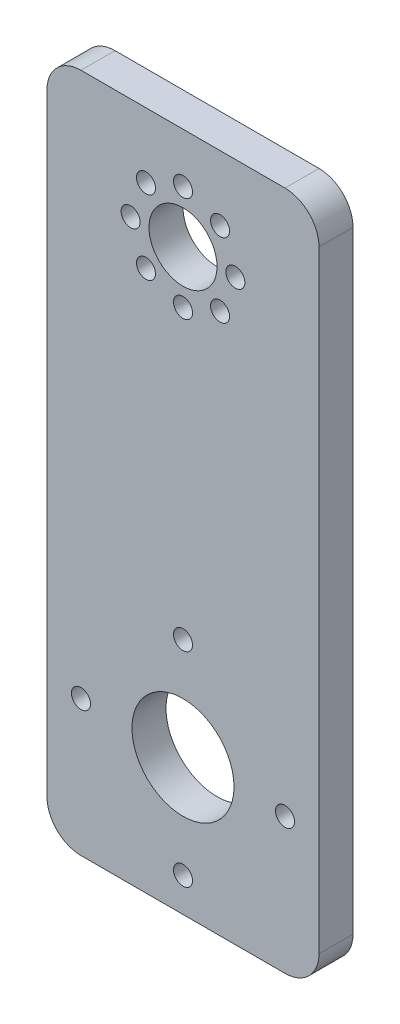
ISO-10303-21;
HEADER;
FILE_DESCRIPTION(('STEP AP214'),'2;1');
FILE_NAME('part.step','',(''),(''),'','','');
FILE_SCHEMA(('AUTOMOTIVE_DESIGN { 1 0 10303 214 1 1 1 1 }'));
ENDSEC;
DATA;
#1=APPLICATION_CONTEXT('core data for automotive mechanical design processes');
#2=APPLICATION_PROTOCOL_DEFINITION('international standard','automotive_design',2000,#1);
#3=PRODUCT_CONTEXT('',#1,'mechanical');
#4=PRODUCT('Part','Part','',(#3));
#5=PRODUCT_RELATED_PRODUCT_CATEGORY('part','',(#4));
#6=PRODUCT_DEFINITION_FORMATION('','',#4);
#7=PRODUCT_DEFINITION_CONTEXT('part definition',#1,'design');
#8=PRODUCT_DEFINITION('design','',#6,#7);
#9=PRODUCT_DEFINITION_SHAPE('','',#8);
#10=(LENGTH_UNIT() NAMED_UNIT(*) SI_UNIT(.MILLI.,.METRE.));
#11=(NAMED_UNIT(*) PLANE_ANGLE_UNIT() SI_UNIT($,.RADIAN.));
#12=(NAMED_UNIT(*) SI_UNIT($,.STERADIAN.) SOLID_ANGLE_UNIT());
#13=UNCERTAINTY_MEASURE_WITH_UNIT(LENGTH_MEASURE(1.E-05),#10,'distance_accuracy_value','');
#14=(GEOMETRIC_REPRESENTATION_CONTEXT(3) GLOBAL_UNCERTAINTY_ASSIGNED_CONTEXT((#13)) GLOBAL_UNIT_ASSIGNED_CONTEXT((#10,
#11,#12)) REPRESENTATION_CONTEXT('',''));
#15=CARTESIAN_POINT('',(0.,0.,0.));
#16=DIRECTION('',(0.,0.,1.));
#17=DIRECTION('',(1.,0.,0.));
#18=AXIS2_PLACEMENT_3D('',#15,#16,#17);
#19=CARTESIAN_POINT('',(0.,0.,6.35));
#20=DIRECTION('',(0.,0.,-1.));
#21=DIRECTION('',(-1.,0.,0.));
#22=AXIS2_PLACEMENT_3D('',#19,#20,#21);
#23=PLANE('',#22);
#24=CARTESIAN_POINT('',(15.621,107.95,6.35));
#25=DIRECTION('',(0.,0.,1.));
#26=DIRECTION('',(0.,1.,0.));
#27=AXIS2_PLACEMENT_3D('',#24,#25,#26);
#28=CIRCLE('',#27,1.778);
#29=CARTESIAN_POINT('',(15.621,109.728,6.35));
#30=VERTEX_POINT('',#29);
#31=EDGE_CURVE('E490',#30,#30,#28,.T.);
#32=ORIENTED_EDGE('',*,*,#31,.F.);
#33=EDGE_LOOP('',(#32));
#34=FACE_BOUND('',#33,.T.);
#35=CARTESIAN_POINT('',(18.4852027867768,101.035202786777,6.35));
#36=DIRECTION('',(0.,0.,1.));
#37=DIRECTION('',(-0.707106781186551,0.707106781186544,0.));
#38=AXIS2_PLACEMENT_3D('',#35,#36,#37);
#39=CIRCLE('',#38,1.778);
#40=CARTESIAN_POINT('',(17.2279669298271,102.292438643726,6.35));
#41=VERTEX_POINT('',#40);
#42=EDGE_CURVE('E484',#41,#41,#39,.T.);
#43=ORIENTED_EDGE('',*,*,#42,.F.);
#44=EDGE_LOOP('',(#43));
#45=FACE_BOUND('',#44,.T.);
#46=CARTESIAN_POINT('',(25.4,98.171,6.35));
#47=DIRECTION('',(0.,0.,1.));
#48=DIRECTION('',(-1.,0.,0.));
#49=AXIS2_PLACEMENT_3D('',#46,#47,#48);
#50=CIRCLE('',#49,1.778);
#51=CARTESIAN_POINT('',(23.622,98.171,6.35));
#52=VERTEX_POINT('',#51);
#53=EDGE_CURVE('E478',#52,#52,#50,.T.);
#54=ORIENTED_EDGE('',*,*,#53,.F.);
#55=EDGE_LOOP('',(#54));
#56=FACE_BOUND('',#55,.T.);
#57=CARTESIAN_POINT('',(32.3147972132233,101.035202786777,6.35));
#58=DIRECTION('',(0.,0.,1.));
#59=DIRECTION('',(-0.707106781186541,-0.707106781186554,0.));
#60=AXIS2_PLACEMENT_3D('',#57,#58,#59);
#61=CIRCLE('',#60,1.778);
#62=CARTESIAN_POINT('',(31.0575613562736,99.7779669298271,6.35));
#63=VERTEX_POINT('',#62);
#64=EDGE_CURVE('E471',#63,#63,#61,.T.);
#65=ORIENTED_EDGE('',*,*,#64,.F.);
#66=EDGE_LOOP('',(#65));
#67=FACE_BOUND('',#66,.T.);
#68=CARTESIAN_POINT('',(35.179,107.95,6.35));
#69=DIRECTION('',(0.,0.,1.));
#70=DIRECTION('',(0.,-1.,0.));
#71=AXIS2_PLACEMENT_3D('',#68,#69,#70);
#72=CIRCLE('',#71,1.778);
#73=CARTESIAN_POINT('',(35.179,106.172,6.35));
#74=VERTEX_POINT('',#73);
#75=EDGE_CURVE('E500',#74,#74,#72,.T.);
#76=ORIENTED_EDGE('',*,*,#75,.F.);
#77=EDGE_LOOP('',(#76));
#78=FACE_BOUND('',#77,.T.);
#79=CARTESIAN_POINT('',(32.3147972132232,114.864797213223,6.35));
#80=DIRECTION('',(0.,0.,1.));
#81=DIRECTION('',(0.707106781186556,-0.707106781186539,0.));
#82=AXIS2_PLACEMENT_3D('',#79,#80,#81);
#83=CIRCLE('',#82,1.778);
#84=CARTESIAN_POINT('',(33.5720330701729,113.607561356274,6.35));
#85=VERTEX_POINT('',#84);
#86=EDGE_CURVE('E494',#85,#85,#83,.T.);
#87=ORIENTED_EDGE('',*,*,#86,.F.);
#88=EDGE_LOOP('',(#87));
#89=FACE_BOUND('',#88,.T.);
#90=CARTESIAN_POINT('',(18.4852027867767,114.864797213223,6.35));
#91=DIRECTION('',(0.,0.,1.));
#92=DIRECTION('',(0.707106781186546,0.707106781186549,0.));
#93=AXIS2_PLACEMENT_3D('',#90,#91,#92);
#94=CIRCLE('',#93,1.778);
#95=CARTESIAN_POINT('',(19.7424386437264,116.122033070173,6.35));
#96=VERTEX_POINT('',#95);
#97=EDGE_CURVE('E465',#96,#96,#94,.T.);
#98=ORIENTED_EDGE('',*,*,#97,.F.);
#99=EDGE_LOOP('',(#98));
#100=FACE_BOUND('',#99,.T.);
#101=CARTESIAN_POINT('',(25.4,117.729,6.35));
#102=DIRECTION('',(0.,0.,1.));
#103=DIRECTION('',(1.,0.,0.));
#104=AXIS2_PLACEMENT_3D('',#101,#102,#103);
#105=CIRCLE('',#104,1.778);
#106=CARTESIAN_POINT('',(27.178,117.729,6.35));
#107=VERTEX_POINT('',#106);
#108=EDGE_CURVE('E443',#107,#107,#105,.T.);
#109=ORIENTED_EDGE('',*,*,#108,.F.);
#110=EDGE_LOOP('',(#109));
#111=FACE_BOUND('',#110,.T.);
#112=CARTESIAN_POINT('',(6.35,25.3999999999999,6.35));
#113=DIRECTION('',(0.,0.,1.));
#114=DIRECTION('',(0.,1.,0.));
#115=AXIS2_PLACEMENT_3D('',#112,#113,#114);
#116=CIRCLE('',#115,1.778);
#117=CARTESIAN_POINT('',(6.35,27.1779999999999,6.35));
#118=VERTEX_POINT('',#117);
#119=EDGE_CURVE('E435',#118,#118,#116,.T.);
#120=ORIENTED_EDGE('',*,*,#119,.F.);
#121=EDGE_LOOP('',(#120));
#122=FACE_BOUND('',#121,.T.);
#123=CARTESIAN_POINT('',(25.4,6.35000000000001,6.35));
#124=DIRECTION('',(0.,0.,1.));
#125=DIRECTION('',(-1.,0.,0.));
#126=AXIS2_PLACEMENT_3D('',#123,#124,#125);
#127=CIRCLE('',#126,1.778);
#128=CARTESIAN_POINT('',(23.622,6.35000000000001,6.35));
#129=VERTEX_POINT('',#128);
#130=EDGE_CURVE('E448',#129,#129,#127,.T.);
#131=ORIENTED_EDGE('',*,*,#130,.F.);
#132=EDGE_LOOP('',(#131));
#133=FACE_BOUND('',#132,.T.);
#134=CARTESIAN_POINT('',(44.45,25.4000000000002,6.35));
#135=DIRECTION('',(0.,0.,1.));
#136=DIRECTION('',(0.,-1.,0.));
#137=AXIS2_PLACEMENT_3D('',#134,#135,#136);
#138=CIRCLE('',#137,1.778);
#139=CARTESIAN_POINT('',(44.45,23.6220000000002,6.35));
#140=VERTEX_POINT('',#139);
#141=EDGE_CURVE('E454',#140,#140,#138,.T.);
#142=ORIENTED_EDGE('',*,*,#141,.F.);
#143=EDGE_LOOP('',(#142));
#144=FACE_BOUND('',#143,.T.);
#145=CARTESIAN_POINT('',(25.4,44.45,6.35));
#146=DIRECTION('',(0.,0.,1.));
#147=DIRECTION('',(1.,0.,0.));
#148=AXIS2_PLACEMENT_3D('',#145,#146,#147);
#149=CIRCLE('',#148,1.778);
#150=CARTESIAN_POINT('',(27.178,44.45,6.35));
#151=VERTEX_POINT('',#150);
#152=EDGE_CURVE('E194',#151,#151,#149,.T.);
#153=ORIENTED_EDGE('',*,*,#152,.F.);
#154=EDGE_LOOP('',(#153));
#155=FACE_BOUND('',#154,.T.);
#156=DIRECTION('',(0.,-1.,0.));
#157=VECTOR('',#156,1.);
#158=CARTESIAN_POINT('',(0.,0.,6.35));
#159=LINE('',#158,#157);
#160=CARTESIAN_POINT('',(0.,120.65,6.35));
#161=VERTEX_POINT('',#160);
#162=CARTESIAN_POINT('',(0.,6.35,6.35));
#163=VERTEX_POINT('',#162);
#164=EDGE_CURVE('E135',#161,#163,#159,.T.);
#165=ORIENTED_EDGE('',*,*,#164,.T.);
#166=CARTESIAN_POINT('',(6.35,6.35,6.35));
#167=DIRECTION('',(0.,0.,-1.));
#168=DIRECTION('',(-1.,0.,0.));
#169=AXIS2_PLACEMENT_3D('',#166,#167,#168);
#170=CIRCLE('',#169,6.35);
#171=CARTESIAN_POINT('',(6.35,0.,6.35));
#172=VERTEX_POINT('',#171);
#173=EDGE_CURVE('E150',#163,#172,#170,.F.);
#174=ORIENTED_EDGE('',*,*,#173,.T.);
#175=DIRECTION('',(1.,0.,0.));
#176=VECTOR('',#175,1.);
#177=CARTESIAN_POINT('',(0.,0.,6.35));
#178=LINE('',#177,#176);
#179=CARTESIAN_POINT('',(44.45,0.,6.35));
#180=VERTEX_POINT('',#179);
#181=EDGE_CURVE('E117',#172,#180,#178,.T.);
#182=ORIENTED_EDGE('',*,*,#181,.T.);
#183=CARTESIAN_POINT('',(44.45,6.35,6.35));
#184=DIRECTION('',(0.,0.,-1.));
#185=DIRECTION('',(-1.,0.,0.));
#186=AXIS2_PLACEMENT_3D('',#183,#184,#185);
#187=CIRCLE('',#186,6.35);
#188=CARTESIAN_POINT('',(50.8,6.35,6.35));
#189=VERTEX_POINT('',#188);
#190=EDGE_CURVE('E148',#180,#189,#187,.F.);
#191=ORIENTED_EDGE('',*,*,#190,.T.);
#192=DIRECTION('',(0.,1.,0.));
#193=VECTOR('',#192,1.);
#194=CARTESIAN_POINT('',(50.8,0.,6.35));
#195=LINE('',#194,#193);
#196=CARTESIAN_POINT('',(50.8,120.65,6.35));
#197=VERTEX_POINT('',#196);
#198=EDGE_CURVE('E170',#189,#197,#195,.T.);
#199=ORIENTED_EDGE('',*,*,#198,.T.);
#200=CARTESIAN_POINT('',(44.45,120.65,6.35));
#201=DIRECTION('',(0.,0.,-1.));
#202=DIRECTION('',(-1.,0.,0.));
#203=AXIS2_PLACEMENT_3D('',#200,#201,#202);
#204=CIRCLE('',#203,6.35);
#205=CARTESIAN_POINT('',(44.45,127.,6.35));
#206=VERTEX_POINT('',#205);
#207=EDGE_CURVE('E52',#197,#206,#204,.F.);
#208=ORIENTED_EDGE('',*,*,#207,.T.);
#209=DIRECTION('',(-1.,0.,0.));
#210=VECTOR('',#209,1.);
#211=CARTESIAN_POINT('',(0.,127.,6.35));
#212=LINE('',#211,#210);
#213=CARTESIAN_POINT('',(6.35,127.,6.35));
#214=VERTEX_POINT('',#213);
#215=EDGE_CURVE('E136',#206,#214,#212,.T.);
#216=ORIENTED_EDGE('',*,*,#215,.T.);
#217=CARTESIAN_POINT('',(6.35,120.65,6.35));
#218=DIRECTION('',(0.,0.,-1.));
#219=DIRECTION('',(-1.,0.,0.));
#220=AXIS2_PLACEMENT_3D('',#217,#218,#219);
#221=CIRCLE('',#220,6.35);
#222=EDGE_CURVE('E146',#214,#161,#221,.F.);
#223=ORIENTED_EDGE('',*,*,#222,.T.);
#224=EDGE_LOOP('',(#165,#174,#182,#191,#199,#208,#216,#223));
#225=FACE_BOUND('',#224,.T.);
#226=CARTESIAN_POINT('',(25.4,25.4,6.35));
#227=DIRECTION('',(0.,0.,1.));
#228=DIRECTION('',(1.,0.,0.));
#229=AXIS2_PLACEMENT_3D('',#226,#227,#228);
#230=CIRCLE('',#229,9.525);
#231=CARTESIAN_POINT('',(34.925,25.4,6.35));
#232=VERTEX_POINT('',#231);
#233=EDGE_CURVE('E130',#232,#232,#230,.T.);
#234=ORIENTED_EDGE('',*,*,#233,.F.);
#235=EDGE_LOOP('',(#234));
#236=FACE_BOUND('',#235,.T.);
#237=CARTESIAN_POINT('',(25.4,107.95,6.35));
#238=DIRECTION('',(0.,0.,1.));
#239=DIRECTION('',(1.,0.,0.));
#240=AXIS2_PLACEMENT_3D('',#237,#238,#239);
#241=CIRCLE('',#240,6.35);
#242=CARTESIAN_POINT('',(31.75,107.95,6.35));
#243=VERTEX_POINT('',#242);
#244=EDGE_CURVE('E185',#243,#243,#241,.T.);
#245=ORIENTED_EDGE('',*,*,#244,.F.);
#246=EDGE_LOOP('',(#245));
#247=FACE_BOUND('',#246,.T.);
#248=ADVANCED_FACE('F32',(#34,#45,#56,#67,#78,#89,#100,#111,#122,#133,#144,#155,#225,#236,#247),
#23,.F.);
#249=CARTESIAN_POINT('',(0.,0.,0.));
#250=DIRECTION('',(0.,0.,-1.));
#251=DIRECTION('',(-1.,0.,0.));
#252=AXIS2_PLACEMENT_3D('',#249,#250,#251);
#253=PLANE('',#252);
#254=CARTESIAN_POINT('',(15.621,107.95,0.));
#255=DIRECTION('',(0.,0.,1.));
#256=DIRECTION('',(0.,1.,0.));
#257=AXIS2_PLACEMENT_3D('',#254,#255,#256);
#258=CIRCLE('',#257,1.778);
#259=CARTESIAN_POINT('',(15.621,109.728,0.));
#260=VERTEX_POINT('',#259);
#261=EDGE_CURVE('E468',#260,#260,#258,.T.);
#262=ORIENTED_EDGE('',*,*,#261,.T.);
#263=EDGE_LOOP('',(#262));
#264=FACE_BOUND('',#263,.T.);
#265=CARTESIAN_POINT('',(18.4852027867768,101.035202786777,0.));
#266=DIRECTION('',(0.,0.,1.));
#267=DIRECTION('',(-0.707106781186551,0.707106781186544,0.));
#268=AXIS2_PLACEMENT_3D('',#265,#266,#267);
#269=CIRCLE('',#268,1.778);
#270=CARTESIAN_POINT('',(17.2279669298271,102.292438643726,0.));
#271=VERTEX_POINT('',#270);
#272=EDGE_CURVE('E487',#271,#271,#269,.T.);
#273=ORIENTED_EDGE('',*,*,#272,.T.);
#274=EDGE_LOOP('',(#273));
#275=FACE_BOUND('',#274,.T.);
#276=CARTESIAN_POINT('',(25.4,98.171,0.));
#277=DIRECTION('',(0.,0.,1.));
#278=DIRECTION('',(-1.,0.,0.));
#279=AXIS2_PLACEMENT_3D('',#276,#277,#278);
#280=CIRCLE('',#279,1.778);
#281=CARTESIAN_POINT('',(23.622,98.171,0.));
#282=VERTEX_POINT('',#281);
#283=EDGE_CURVE('E481',#282,#282,#280,.T.);
#284=ORIENTED_EDGE('',*,*,#283,.T.);
#285=EDGE_LOOP('',(#284));
#286=FACE_BOUND('',#285,.T.);
#287=CARTESIAN_POINT('',(32.3147972132233,101.035202786777,0.));
#288=DIRECTION('',(0.,0.,1.));
#289=DIRECTION('',(-0.707106781186541,-0.707106781186554,0.));
#290=AXIS2_PLACEMENT_3D('',#287,#288,#289);
#291=CIRCLE('',#290,1.778);
#292=CARTESIAN_POINT('',(31.0575613562736,99.7779669298271,0.));
#293=VERTEX_POINT('',#292);
#294=EDGE_CURVE('E474',#293,#293,#291,.T.);
#295=ORIENTED_EDGE('',*,*,#294,.T.);
#296=EDGE_LOOP('',(#295));
#297=FACE_BOUND('',#296,.T.);
#298=CARTESIAN_POINT('',(35.179,107.95,0.));
#299=DIRECTION('',(0.,0.,1.));
#300=DIRECTION('',(0.,-1.,0.));
#301=AXIS2_PLACEMENT_3D('',#298,#299,#300);
#302=CIRCLE('',#301,1.778);
#303=CARTESIAN_POINT('',(35.179,106.172,0.));
#304=VERTEX_POINT('',#303);
#305=EDGE_CURVE('E475',#304,#304,#302,.T.);
#306=ORIENTED_EDGE('',*,*,#305,.T.);
#307=EDGE_LOOP('',(#306));
#308=FACE_BOUND('',#307,.T.);
#309=CARTESIAN_POINT('',(32.3147972132232,114.864797213223,0.));
#310=DIRECTION('',(0.,0.,1.));
#311=DIRECTION('',(0.707106781186556,-0.707106781186539,0.));
#312=AXIS2_PLACEMENT_3D('',#309,#310,#311);
#313=CIRCLE('',#312,1.778);
#314=CARTESIAN_POINT('',(33.5720330701729,113.607561356274,0.));
#315=VERTEX_POINT('',#314);
#316=EDGE_CURVE('E497',#315,#315,#313,.T.);
#317=ORIENTED_EDGE('',*,*,#316,.T.);
#318=EDGE_LOOP('',(#317));
#319=FACE_BOUND('',#318,.T.);
#320=CARTESIAN_POINT('',(18.4852027867767,114.864797213223,0.));
#321=DIRECTION('',(0.,0.,1.));
#322=DIRECTION('',(0.707106781186546,0.707106781186549,0.));
#323=AXIS2_PLACEMENT_3D('',#320,#321,#322);
#324=CIRCLE('',#323,1.778);
#325=CARTESIAN_POINT('',(19.7424386437264,116.122033070173,0.));
#326=VERTEX_POINT('',#325);
#327=EDGE_CURVE('E463',#326,#326,#324,.T.);
#328=ORIENTED_EDGE('',*,*,#327,.T.);
#329=EDGE_LOOP('',(#328));
#330=FACE_BOUND('',#329,.T.);
#331=CARTESIAN_POINT('',(25.4,117.729,0.));
#332=DIRECTION('',(0.,0.,1.));
#333=DIRECTION('',(1.,0.,0.));
#334=AXIS2_PLACEMENT_3D('',#331,#332,#333);
#335=CIRCLE('',#334,1.778);
#336=CARTESIAN_POINT('',(27.178,117.729,0.));
#337=VERTEX_POINT('',#336);
#338=EDGE_CURVE('E456',#337,#337,#335,.T.);
#339=ORIENTED_EDGE('',*,*,#338,.T.);
#340=EDGE_LOOP('',(#339));
#341=FACE_BOUND('',#340,.T.);
#342=CARTESIAN_POINT('',(6.35,25.3999999999999,0.));
#343=DIRECTION('',(0.,0.,1.));
#344=DIRECTION('',(0.,1.,0.));
#345=AXIS2_PLACEMENT_3D('',#342,#343,#344);
#346=CIRCLE('',#345,1.778);
#347=CARTESIAN_POINT('',(6.35,27.1779999999999,0.));
#348=VERTEX_POINT('',#347);
#349=EDGE_CURVE('E433',#348,#348,#346,.T.);
#350=ORIENTED_EDGE('',*,*,#349,.T.);
#351=EDGE_LOOP('',(#350));
#352=FACE_BOUND('',#351,.T.);
#353=CARTESIAN_POINT('',(25.4,6.35000000000001,0.));
#354=DIRECTION('',(0.,0.,1.));
#355=DIRECTION('',(-1.,0.,0.));
#356=AXIS2_PLACEMENT_3D('',#353,#354,#355);
#357=CIRCLE('',#356,1.778);
#358=CARTESIAN_POINT('',(23.622,6.35000000000001,0.));
#359=VERTEX_POINT('',#358);
#360=EDGE_CURVE('E440',#359,#359,#357,.T.);
#361=ORIENTED_EDGE('',*,*,#360,.T.);
#362=EDGE_LOOP('',(#361));
#363=FACE_BOUND('',#362,.T.);
#364=CARTESIAN_POINT('',(44.45,25.4000000000002,0.));
#365=DIRECTION('',(0.,0.,1.));
#366=DIRECTION('',(0.,-1.,0.));
#367=AXIS2_PLACEMENT_3D('',#364,#365,#366);
#368=CIRCLE('',#367,1.778);
#369=CARTESIAN_POINT('',(44.45,23.6220000000002,0.));
#370=VERTEX_POINT('',#369);
#371=EDGE_CURVE('E451',#370,#370,#368,.T.);
#372=ORIENTED_EDGE('',*,*,#371,.T.);
#373=EDGE_LOOP('',(#372));
#374=FACE_BOUND('',#373,.T.);
#375=CARTESIAN_POINT('',(25.4,44.45,0.));
#376=DIRECTION('',(0.,0.,1.));
#377=DIRECTION('',(1.,0.,0.));
#378=AXIS2_PLACEMENT_3D('',#375,#376,#377);
#379=CIRCLE('',#378,1.778);
#380=CARTESIAN_POINT('',(27.178,44.45,0.));
#381=VERTEX_POINT('',#380);
#382=EDGE_CURVE('E191',#381,#381,#379,.T.);
#383=ORIENTED_EDGE('',*,*,#382,.T.);
#384=EDGE_LOOP('',(#383));
#385=FACE_BOUND('',#384,.T.);
#386=CARTESIAN_POINT('',(25.4,25.4,0.));
#387=DIRECTION('',(0.,0.,1.));
#388=DIRECTION('',(1.,0.,0.));
#389=AXIS2_PLACEMENT_3D('',#386,#387,#388);
#390=CIRCLE('',#389,9.525);
#391=CARTESIAN_POINT('',(34.925,25.4,0.));
#392=VERTEX_POINT('',#391);
#393=EDGE_CURVE('E173',#392,#392,#390,.T.);
#394=ORIENTED_EDGE('',*,*,#393,.T.);
#395=EDGE_LOOP('',(#394));
#396=FACE_BOUND('',#395,.T.);
#397=DIRECTION('',(1.,0.,0.));
#398=VECTOR('',#397,1.);
#399=CARTESIAN_POINT('',(0.,0.,0.));
#400=LINE('',#399,#398);
#401=CARTESIAN_POINT('',(6.35,0.,0.));
#402=VERTEX_POINT('',#401);
#403=CARTESIAN_POINT('',(44.45,0.,0.));
#404=VERTEX_POINT('',#403);
#405=EDGE_CURVE('E114',#402,#404,#400,.T.);
#406=ORIENTED_EDGE('',*,*,#405,.F.);
#407=CARTESIAN_POINT('',(6.35,6.35,0.));
#408=DIRECTION('',(0.,0.,-1.));
#409=DIRECTION('',(-1.,0.,0.));
#410=AXIS2_PLACEMENT_3D('',#407,#408,#409);
#411=CIRCLE('',#410,6.35);
#412=CARTESIAN_POINT('',(0.,6.35,0.));
#413=VERTEX_POINT('',#412);
#414=EDGE_CURVE('E97',#402,#413,#411,.T.);
#415=ORIENTED_EDGE('',*,*,#414,.T.);
#416=DIRECTION('',(0.,-1.,0.));
#417=VECTOR('',#416,1.);
#418=CARTESIAN_POINT('',(0.,0.,0.));
#419=LINE('',#418,#417);
#420=CARTESIAN_POINT('',(0.,120.65,0.));
#421=VERTEX_POINT('',#420);
#422=EDGE_CURVE('E125',#421,#413,#419,.T.);
#423=ORIENTED_EDGE('',*,*,#422,.F.);
#424=CARTESIAN_POINT('',(6.35,120.65,0.));
#425=DIRECTION('',(0.,0.,-1.));
#426=DIRECTION('',(-1.,0.,0.));
#427=AXIS2_PLACEMENT_3D('',#424,#425,#426);
#428=CIRCLE('',#427,6.35);
#429=CARTESIAN_POINT('',(6.35,127.,0.));
#430=VERTEX_POINT('',#429);
#431=EDGE_CURVE('E139',#421,#430,#428,.T.);
#432=ORIENTED_EDGE('',*,*,#431,.T.);
#433=DIRECTION('',(-1.,0.,0.));
#434=VECTOR('',#433,1.);
#435=CARTESIAN_POINT('',(0.,127.,0.));
#436=LINE('',#435,#434);
#437=CARTESIAN_POINT('',(44.45,127.,0.));
#438=VERTEX_POINT('',#437);
#439=EDGE_CURVE('E128',#438,#430,#436,.T.);
#440=ORIENTED_EDGE('',*,*,#439,.F.);
#441=CARTESIAN_POINT('',(44.45,120.65,0.));
#442=DIRECTION('',(0.,0.,-1.));
#443=DIRECTION('',(-1.,0.,0.));
#444=AXIS2_PLACEMENT_3D('',#441,#442,#443);
#445=CIRCLE('',#444,6.35);
#446=CARTESIAN_POINT('',(50.8,120.65,0.));
#447=VERTEX_POINT('',#446);
#448=EDGE_CURVE('E118',#438,#447,#445,.T.);
#449=ORIENTED_EDGE('',*,*,#448,.T.);
#450=DIRECTION('',(0.,1.,0.));
#451=VECTOR('',#450,1.);
#452=CARTESIAN_POINT('',(50.8,0.,0.));
#453=LINE('',#452,#451);
#454=CARTESIAN_POINT('',(50.8,6.35,0.));
#455=VERTEX_POINT('',#454);
#456=EDGE_CURVE('E124',#455,#447,#453,.T.);
#457=ORIENTED_EDGE('',*,*,#456,.F.);
#458=CARTESIAN_POINT('',(44.45,6.35,0.));
#459=DIRECTION('',(0.,0.,-1.));
#460=DIRECTION('',(-1.,0.,0.));
#461=AXIS2_PLACEMENT_3D('',#458,#459,#460);
#462=CIRCLE('',#461,6.35);
#463=EDGE_CURVE('E108',#455,#404,#462,.T.);
#464=ORIENTED_EDGE('',*,*,#463,.T.);
#465=EDGE_LOOP('',(#406,#415,#423,#432,#440,#449,#457,#464));
#466=FACE_BOUND('',#465,.T.);
#467=CARTESIAN_POINT('',(25.4,107.95,0.));
#468=DIRECTION('',(0.,0.,1.));
#469=DIRECTION('',(1.,0.,0.));
#470=AXIS2_PLACEMENT_3D('',#467,#468,#469);
#471=CIRCLE('',#470,6.35);
#472=CARTESIAN_POINT('',(31.75,107.95,0.));
#473=VERTEX_POINT('',#472);
#474=EDGE_CURVE('E187',#473,#473,#471,.T.);
#475=ORIENTED_EDGE('',*,*,#474,.T.);
#476=EDGE_LOOP('',(#475));
#477=FACE_BOUND('',#476,.T.);
#478=ADVANCED_FACE('F121',(#264,#275,#286,#297,#308,#319,#330,#341,#352,#363,#374,#385,#396,
#466,#477),#253,.T.);
#479=CARTESIAN_POINT('',(0.,0.,6.35));
#480=DIRECTION('',(1.,0.,0.));
#481=DIRECTION('',(0.,0.,-1.));
#482=AXIS2_PLACEMENT_3D('',#479,#480,#481);
#483=PLANE('',#482);
#484=ORIENTED_EDGE('',*,*,#422,.T.);
#485=DIRECTION('',(0.,0.,-1.));
#486=VECTOR('',#485,1.);
#487=CARTESIAN_POINT('',(0.,6.35,6.35));
#488=LINE('',#487,#486);
#489=EDGE_CURVE('E102',#413,#163,#488,.F.);
#490=ORIENTED_EDGE('',*,*,#489,.T.);
#491=ORIENTED_EDGE('',*,*,#164,.F.);
#492=DIRECTION('',(0.,0.,-1.));
#493=VECTOR('',#492,1.);
#494=CARTESIAN_POINT('',(0.,120.65,6.35));
#495=LINE('',#494,#493);
#496=EDGE_CURVE('E107',#161,#421,#495,.T.);
#497=ORIENTED_EDGE('',*,*,#496,.T.);
#498=EDGE_LOOP('',(#484,#490,#491,#497));
#499=FACE_BOUND('',#498,.T.);
#500=ADVANCED_FACE('F167',(#499),#483,.F.);
#501=CARTESIAN_POINT('',(0.,0.,6.35));
#502=DIRECTION('',(0.,1.,0.));
#503=DIRECTION('',(0.,0.,1.));
#504=AXIS2_PLACEMENT_3D('',#501,#502,#503);
#505=PLANE('',#504);
#506=ORIENTED_EDGE('',*,*,#181,.F.);
#507=DIRECTION('',(0.,0.,-1.));
#508=VECTOR('',#507,1.);
#509=CARTESIAN_POINT('',(6.35,0.,6.35));
#510=LINE('',#509,#508);
#511=EDGE_CURVE('E101',#172,#402,#510,.T.);
#512=ORIENTED_EDGE('',*,*,#511,.T.);
#513=ORIENTED_EDGE('',*,*,#405,.T.);
#514=DIRECTION('',(0.,0.,-1.));
#515=VECTOR('',#514,1.);
#516=CARTESIAN_POINT('',(44.45,0.,6.35));
#517=LINE('',#516,#515);
#518=EDGE_CURVE('E119',#404,#180,#517,.F.);
#519=ORIENTED_EDGE('',*,*,#518,.T.);
#520=EDGE_LOOP('',(#506,#512,#513,#519));
#521=FACE_BOUND('',#520,.T.);
#522=ADVANCED_FACE('F113',(#521),#505,.F.);
#523=CARTESIAN_POINT('',(50.8,0.,6.35));
#524=DIRECTION('',(-1.,0.,0.));
#525=DIRECTION('',(0.,0.,1.));
#526=AXIS2_PLACEMENT_3D('',#523,#524,#525);
#527=PLANE('',#526);
#528=ORIENTED_EDGE('',*,*,#198,.F.);
#529=DIRECTION('',(0.,0.,-1.));
#530=VECTOR('',#529,1.);
#531=CARTESIAN_POINT('',(50.8,6.35,6.35));
#532=LINE('',#531,#530);
#533=EDGE_CURVE('E154',#189,#455,#532,.T.);
#534=ORIENTED_EDGE('',*,*,#533,.T.);
#535=ORIENTED_EDGE('',*,*,#456,.T.);
#536=DIRECTION('',(0.,0.,-1.));
#537=VECTOR('',#536,1.);
#538=CARTESIAN_POINT('',(50.8,120.65,6.35));
#539=LINE('',#538,#537);
#540=EDGE_CURVE('E152',#447,#197,#539,.F.);
#541=ORIENTED_EDGE('',*,*,#540,.T.);
#542=EDGE_LOOP('',(#528,#534,#535,#541));
#543=FACE_BOUND('',#542,.T.);
#544=ADVANCED_FACE('F216',(#543),#527,.F.);
#545=CARTESIAN_POINT('',(0.,127.,6.35));
#546=DIRECTION('',(0.,-1.,0.));
#547=DIRECTION('',(0.,0.,-1.));
#548=AXIS2_PLACEMENT_3D('',#545,#546,#547);
#549=PLANE('',#548);
#550=ORIENTED_EDGE('',*,*,#439,.T.);
#551=DIRECTION('',(0.,0.,-1.));
#552=VECTOR('',#551,1.);
#553=CARTESIAN_POINT('',(6.35,127.,6.35));
#554=LINE('',#553,#552);
#555=EDGE_CURVE('E11',#430,#214,#554,.F.);
#556=ORIENTED_EDGE('',*,*,#555,.T.);
#557=ORIENTED_EDGE('',*,*,#215,.F.);
#558=DIRECTION('',(0.,0.,-1.));
#559=VECTOR('',#558,1.);
#560=CARTESIAN_POINT('',(44.45,127.,6.35));
#561=LINE('',#560,#559);
#562=EDGE_CURVE('E40',#206,#438,#561,.T.);
#563=ORIENTED_EDGE('',*,*,#562,.T.);
#564=EDGE_LOOP('',(#550,#556,#557,#563));
#565=FACE_BOUND('',#564,.T.);
#566=ADVANCED_FACE('F159',(#565),#549,.F.);
#567=CARTESIAN_POINT('',(25.4,25.4,6.35));
#568=DIRECTION('',(0.,0.,-1.));
#569=DIRECTION('',(-1.,0.,0.));
#570=AXIS2_PLACEMENT_3D('',#567,#568,#569);
#571=CYLINDRICAL_SURFACE('',#570,9.525);
#572=ORIENTED_EDGE('',*,*,#233,.T.);
#573=EDGE_LOOP('',(#572));
#574=FACE_BOUND('',#573,.T.);
#575=ORIENTED_EDGE('',*,*,#393,.F.);
#576=EDGE_LOOP('',(#575));
#577=FACE_BOUND('',#576,.T.);
#578=ADVANCED_FACE('F197',(#574,#577),#571,.F.);
#579=CARTESIAN_POINT('',(25.4,107.95,6.35));
#580=DIRECTION('',(0.,0.,-1.));
#581=DIRECTION('',(-1.,0.,0.));
#582=AXIS2_PLACEMENT_3D('',#579,#580,#581);
#583=CYLINDRICAL_SURFACE('',#582,6.35);
#584=ORIENTED_EDGE('',*,*,#244,.T.);
#585=EDGE_LOOP('',(#584));
#586=FACE_BOUND('',#585,.T.);
#587=ORIENTED_EDGE('',*,*,#474,.F.);
#588=EDGE_LOOP('',(#587));
#589=FACE_BOUND('',#588,.T.);
#590=ADVANCED_FACE('F200',(#586,#589),#583,.F.);
#591=CARTESIAN_POINT('',(25.4,44.45,0.));
#592=DIRECTION('',(0.,0.,1.));
#593=DIRECTION('',(1.,0.,0.));
#594=AXIS2_PLACEMENT_3D('',#591,#592,#593);
#595=CYLINDRICAL_SURFACE('',#594,1.778);
#596=ORIENTED_EDGE('',*,*,#382,.F.);
#597=EDGE_LOOP('',(#596));
#598=FACE_BOUND('',#597,.T.);
#599=ORIENTED_EDGE('',*,*,#152,.T.);
#600=EDGE_LOOP('',(#599));
#601=FACE_BOUND('',#600,.T.);
#602=ADVANCED_FACE('F398',(#598,#601),#595,.F.);
#603=CARTESIAN_POINT('',(44.45,25.4000000000002,0.));
#604=DIRECTION('',(0.,0.,1.));
#605=DIRECTION('',(1.,0.,0.));
#606=AXIS2_PLACEMENT_3D('',#603,#604,#605);
#607=CYLINDRICAL_SURFACE('',#606,1.778);
#608=ORIENTED_EDGE('',*,*,#371,.F.);
#609=EDGE_LOOP('',(#608));
#610=FACE_BOUND('',#609,.T.);
#611=ORIENTED_EDGE('',*,*,#141,.T.);
#612=EDGE_LOOP('',(#611));
#613=FACE_BOUND('',#612,.T.);
#614=ADVANCED_FACE('F388',(#610,#613),#607,.F.);
#615=CARTESIAN_POINT('',(25.4,6.35000000000001,0.));
#616=DIRECTION('',(0.,0.,1.));
#617=DIRECTION('',(1.,0.,0.));
#618=AXIS2_PLACEMENT_3D('',#615,#616,#617);
#619=CYLINDRICAL_SURFACE('',#618,1.778);
#620=ORIENTED_EDGE('',*,*,#360,.F.);
#621=EDGE_LOOP('',(#620));
#622=FACE_BOUND('',#621,.T.);
#623=ORIENTED_EDGE('',*,*,#130,.T.);
#624=EDGE_LOOP('',(#623));
#625=FACE_BOUND('',#624,.T.);
#626=ADVANCED_FACE('F378',(#622,#625),#619,.F.);
#627=CARTESIAN_POINT('',(6.35,25.3999999999999,0.));
#628=DIRECTION('',(0.,0.,1.));
#629=DIRECTION('',(1.,0.,0.));
#630=AXIS2_PLACEMENT_3D('',#627,#628,#629);
#631=CYLINDRICAL_SURFACE('',#630,1.778);
#632=ORIENTED_EDGE('',*,*,#349,.F.);
#633=EDGE_LOOP('',(#632));
#634=FACE_BOUND('',#633,.T.);
#635=ORIENTED_EDGE('',*,*,#119,.T.);
#636=EDGE_LOOP('',(#635));
#637=FACE_BOUND('',#636,.T.);
#638=ADVANCED_FACE('F368',(#634,#637),#631,.F.);
#639=CARTESIAN_POINT('',(25.4,117.729,0.));
#640=DIRECTION('',(0.,0.,1.));
#641=DIRECTION('',(1.,0.,0.));
#642=AXIS2_PLACEMENT_3D('',#639,#640,#641);
#643=CYLINDRICAL_SURFACE('',#642,1.778);
#644=ORIENTED_EDGE('',*,*,#338,.F.);
#645=EDGE_LOOP('',(#644));
#646=FACE_BOUND('',#645,.T.);
#647=ORIENTED_EDGE('',*,*,#108,.T.);
#648=EDGE_LOOP('',(#647));
#649=FACE_BOUND('',#648,.T.);
#650=ADVANCED_FACE('F358',(#646,#649),#643,.F.);
#651=CARTESIAN_POINT('',(18.4852027867767,114.864797213223,0.));
#652=DIRECTION('',(0.,0.,1.));
#653=DIRECTION('',(1.,0.,0.));
#654=AXIS2_PLACEMENT_3D('',#651,#652,#653);
#655=CYLINDRICAL_SURFACE('',#654,1.778);
#656=ORIENTED_EDGE('',*,*,#327,.F.);
#657=EDGE_LOOP('',(#656));
#658=FACE_BOUND('',#657,.T.);
#659=ORIENTED_EDGE('',*,*,#97,.T.);
#660=EDGE_LOOP('',(#659));
#661=FACE_BOUND('',#660,.T.);
#662=ADVANCED_FACE('F348',(#658,#661),#655,.F.);
#663=CARTESIAN_POINT('',(32.3147972132232,114.864797213223,0.));
#664=DIRECTION('',(0.,0.,1.));
#665=DIRECTION('',(1.,0.,0.));
#666=AXIS2_PLACEMENT_3D('',#663,#664,#665);
#667=CYLINDRICAL_SURFACE('',#666,1.778);
#668=ORIENTED_EDGE('',*,*,#316,.F.);
#669=EDGE_LOOP('',(#668));
#670=FACE_BOUND('',#669,.T.);
#671=ORIENTED_EDGE('',*,*,#86,.T.);
#672=EDGE_LOOP('',(#671));
#673=FACE_BOUND('',#672,.T.);
#674=ADVANCED_FACE('F338',(#670,#673),#667,.F.);
#675=CARTESIAN_POINT('',(35.179,107.95,0.));
#676=DIRECTION('',(0.,0.,1.));
#677=DIRECTION('',(1.,0.,0.));
#678=AXIS2_PLACEMENT_3D('',#675,#676,#677);
#679=CYLINDRICAL_SURFACE('',#678,1.778);
#680=ORIENTED_EDGE('',*,*,#305,.F.);
#681=EDGE_LOOP('',(#680));
#682=FACE_BOUND('',#681,.T.);
#683=ORIENTED_EDGE('',*,*,#75,.T.);
#684=EDGE_LOOP('',(#683));
#685=FACE_BOUND('',#684,.T.);
#686=ADVANCED_FACE('F328',(#682,#685),#679,.F.);
#687=CARTESIAN_POINT('',(32.3147972132233,101.035202786777,0.));
#688=DIRECTION('',(0.,0.,1.));
#689=DIRECTION('',(1.,0.,0.));
#690=AXIS2_PLACEMENT_3D('',#687,#688,#689);
#691=CYLINDRICAL_SURFACE('',#690,1.778);
#692=ORIENTED_EDGE('',*,*,#294,.F.);
#693=EDGE_LOOP('',(#692));
#694=FACE_BOUND('',#693,.T.);
#695=ORIENTED_EDGE('',*,*,#64,.T.);
#696=EDGE_LOOP('',(#695));
#697=FACE_BOUND('',#696,.T.);
#698=ADVANCED_FACE('F318',(#694,#697),#691,.F.);
#699=CARTESIAN_POINT('',(25.4,98.171,0.));
#700=DIRECTION('',(0.,0.,1.));
#701=DIRECTION('',(1.,0.,0.));
#702=AXIS2_PLACEMENT_3D('',#699,#700,#701);
#703=CYLINDRICAL_SURFACE('',#702,1.778);
#704=ORIENTED_EDGE('',*,*,#283,.F.);
#705=EDGE_LOOP('',(#704));
#706=FACE_BOUND('',#705,.T.);
#707=ORIENTED_EDGE('',*,*,#53,.T.);
#708=EDGE_LOOP('',(#707));
#709=FACE_BOUND('',#708,.T.);
#710=ADVANCED_FACE('F308',(#706,#709),#703,.F.);
#711=CARTESIAN_POINT('',(18.4852027867768,101.035202786777,0.));
#712=DIRECTION('',(0.,0.,1.));
#713=DIRECTION('',(1.,0.,0.));
#714=AXIS2_PLACEMENT_3D('',#711,#712,#713);
#715=CYLINDRICAL_SURFACE('',#714,1.778);
#716=ORIENTED_EDGE('',*,*,#272,.F.);
#717=EDGE_LOOP('',(#716));
#718=FACE_BOUND('',#717,.T.);
#719=ORIENTED_EDGE('',*,*,#42,.T.);
#720=EDGE_LOOP('',(#719));
#721=FACE_BOUND('',#720,.T.);
#722=ADVANCED_FACE('F298',(#718,#721),#715,.F.);
#723=CARTESIAN_POINT('',(15.621,107.95,0.));
#724=DIRECTION('',(0.,0.,1.));
#725=DIRECTION('',(1.,0.,0.));
#726=AXIS2_PLACEMENT_3D('',#723,#724,#725);
#727=CYLINDRICAL_SURFACE('',#726,1.778);
#728=ORIENTED_EDGE('',*,*,#261,.F.);
#729=EDGE_LOOP('',(#728));
#730=FACE_BOUND('',#729,.T.);
#731=ORIENTED_EDGE('',*,*,#31,.T.);
#732=EDGE_LOOP('',(#731));
#733=FACE_BOUND('',#732,.T.);
#734=ADVANCED_FACE('F225',(#730,#733),#727,.F.);
#735=CARTESIAN_POINT('',(6.35,6.35,6.35));
#736=DIRECTION('',(0.,0.,-1.));
#737=DIRECTION('',(-1.,0.,0.));
#738=AXIS2_PLACEMENT_3D('',#735,#736,#737);
#739=CYLINDRICAL_SURFACE('',#738,6.35);
#740=ORIENTED_EDGE('',*,*,#173,.F.);
#741=ORIENTED_EDGE('',*,*,#489,.F.);
#742=ORIENTED_EDGE('',*,*,#414,.F.);
#743=ORIENTED_EDGE('',*,*,#511,.F.);
#744=EDGE_LOOP('',(#740,#741,#742,#743));
#745=FACE_BOUND('',#744,.T.);
#746=ADVANCED_FACE('F100',(#745),#739,.T.);
#747=CARTESIAN_POINT('',(44.45,6.35,6.35));
#748=DIRECTION('',(0.,0.,-1.));
#749=DIRECTION('',(-1.,0.,0.));
#750=AXIS2_PLACEMENT_3D('',#747,#748,#749);
#751=CYLINDRICAL_SURFACE('',#750,6.35);
#752=ORIENTED_EDGE('',*,*,#190,.F.);
#753=ORIENTED_EDGE('',*,*,#518,.F.);
#754=ORIENTED_EDGE('',*,*,#463,.F.);
#755=ORIENTED_EDGE('',*,*,#533,.F.);
#756=EDGE_LOOP('',(#752,#753,#754,#755));
#757=FACE_BOUND('',#756,.T.);
#758=ADVANCED_FACE('F224',(#757),#751,.T.);
#759=CARTESIAN_POINT('',(6.35,120.65,6.35));
#760=DIRECTION('',(0.,0.,-1.));
#761=DIRECTION('',(-1.,0.,0.));
#762=AXIS2_PLACEMENT_3D('',#759,#760,#761);
#763=CYLINDRICAL_SURFACE('',#762,6.35);
#764=ORIENTED_EDGE('',*,*,#222,.F.);
#765=ORIENTED_EDGE('',*,*,#555,.F.);
#766=ORIENTED_EDGE('',*,*,#431,.F.);
#767=ORIENTED_EDGE('',*,*,#496,.F.);
#768=EDGE_LOOP('',(#764,#765,#766,#767));
#769=FACE_BOUND('',#768,.T.);
#770=ADVANCED_FACE('F164',(#769),#763,.T.);
#771=CARTESIAN_POINT('',(44.45,120.65,6.35));
#772=DIRECTION('',(0.,0.,-1.));
#773=DIRECTION('',(-1.,0.,0.));
#774=AXIS2_PLACEMENT_3D('',#771,#772,#773);
#775=CYLINDRICAL_SURFACE('',#774,6.35);
#776=ORIENTED_EDGE('',*,*,#207,.F.);
#777=ORIENTED_EDGE('',*,*,#540,.F.);
#778=ORIENTED_EDGE('',*,*,#448,.F.);
#779=ORIENTED_EDGE('',*,*,#562,.F.);
#780=EDGE_LOOP('',(#776,#777,#778,#779));
#781=FACE_BOUND('',#780,.T.);
#782=ADVANCED_FACE('F34',(#781),#775,.T.);
#783=CLOSED_SHELL('',(#248,#478,#500,#522,#544,#566,#578,#590,#602,#614,#626,#638,#650,#662,
#674,#686,#698,#710,#722,#734,#746,#758,#770,#782));
#784=MANIFOLD_SOLID_BREP('B2',#783);
#785=ADVANCED_BREP_SHAPE_REPRESENTATION('',(#18,#784),#14);
#786=SHAPE_DEFINITION_REPRESENTATION(#9,#785);
ENDSEC;
END-ISO-10303-21;
